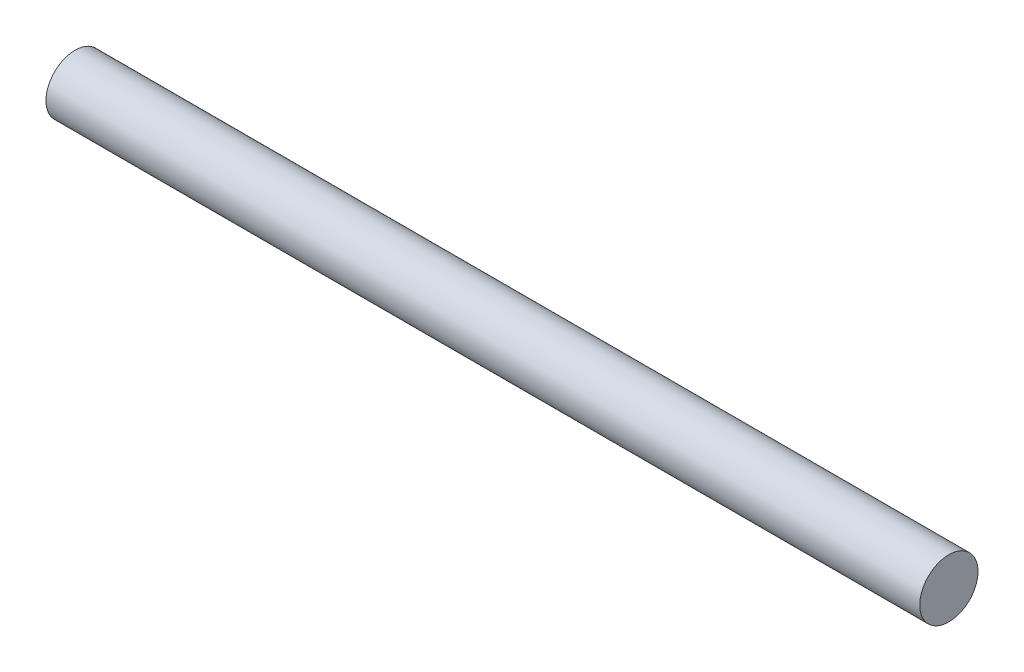
ISO-10303-21;
HEADER;
FILE_DESCRIPTION(('STEP AP214'),'2;1');
FILE_NAME('part.step','',(''),(''),'','','');
FILE_SCHEMA(('AUTOMOTIVE_DESIGN { 1 0 10303 214 1 1 1 1 }'));
ENDSEC;
DATA;
#1=APPLICATION_CONTEXT('core data for automotive mechanical design processes');
#2=APPLICATION_PROTOCOL_DEFINITION('international standard','automotive_design',2000,#1);
#3=PRODUCT_CONTEXT('',#1,'mechanical');
#4=PRODUCT('Part','Part','',(#3));
#5=PRODUCT_RELATED_PRODUCT_CATEGORY('part','',(#4));
#6=PRODUCT_DEFINITION_FORMATION('','',#4);
#7=PRODUCT_DEFINITION_CONTEXT('part definition',#1,'design');
#8=PRODUCT_DEFINITION('design','',#6,#7);
#9=PRODUCT_DEFINITION_SHAPE('','',#8);
#10=(LENGTH_UNIT() NAMED_UNIT(*) SI_UNIT(.MILLI.,.METRE.));
#11=(NAMED_UNIT(*) PLANE_ANGLE_UNIT() SI_UNIT($,.RADIAN.));
#12=(NAMED_UNIT(*) SI_UNIT($,.STERADIAN.) SOLID_ANGLE_UNIT());
#13=UNCERTAINTY_MEASURE_WITH_UNIT(LENGTH_MEASURE(1.E-05),#10,'distance_accuracy_value','');
#14=(GEOMETRIC_REPRESENTATION_CONTEXT(3) GLOBAL_UNCERTAINTY_ASSIGNED_CONTEXT((#13)) GLOBAL_UNIT_ASSIGNED_CONTEXT((#10,
#11,#12)) REPRESENTATION_CONTEXT('',''));
#15=CARTESIAN_POINT('',(0.,0.,0.));
#16=DIRECTION('',(0.,0.,1.));
#17=DIRECTION('',(1.,0.,0.));
#18=AXIS2_PLACEMENT_3D('',#15,#16,#17);
#19=CARTESIAN_POINT('',(120.,0.,0.));
#20=DIRECTION('',(-1.,0.,0.));
#21=DIRECTION('',(0.,0.,1.));
#22=AXIS2_PLACEMENT_3D('',#19,#20,#21);
#23=CYLINDRICAL_SURFACE('',#22,4.);
#24=CARTESIAN_POINT('',(120.,0.,0.));
#25=DIRECTION('',(1.,0.,0.));
#26=DIRECTION('',(0.,0.,-1.));
#27=AXIS2_PLACEMENT_3D('',#24,#25,#26);
#28=CIRCLE('',#27,4.);
#29=CARTESIAN_POINT('',(120.,0.,-4.));
#30=VERTEX_POINT('',#29);
#31=EDGE_CURVE('E10',#30,#30,#28,.T.);
#32=ORIENTED_EDGE('',*,*,#31,.F.);
#33=EDGE_LOOP('',(#32));
#34=FACE_BOUND('',#33,.T.);
#35=CARTESIAN_POINT('',(0.,0.,0.));
#36=DIRECTION('',(1.,0.,0.));
#37=DIRECTION('',(0.,0.,-1.));
#38=AXIS2_PLACEMENT_3D('',#35,#36,#37);
#39=CIRCLE('',#38,4.);
#40=CARTESIAN_POINT('',(0.,0.,-4.));
#41=VERTEX_POINT('',#40);
#42=EDGE_CURVE('E42',#41,#41,#39,.T.);
#43=ORIENTED_EDGE('',*,*,#42,.T.);
#44=EDGE_LOOP('',(#43));
#45=FACE_BOUND('',#44,.T.);
#46=ADVANCED_FACE('F39',(#34,#45),#23,.T.);
#47=CARTESIAN_POINT('',(120.,0.,0.));
#48=DIRECTION('',(1.,0.,0.));
#49=DIRECTION('',(0.,0.,-1.));
#50=AXIS2_PLACEMENT_3D('',#47,#48,#49);
#51=PLANE('',#50);
#52=ORIENTED_EDGE('',*,*,#31,.T.);
#53=EDGE_LOOP('',(#52));
#54=FACE_BOUND('',#53,.T.);
#55=ADVANCED_FACE('F56',(#54),#51,.T.);
#56=CARTESIAN_POINT('',(0.,0.,0.));
#57=DIRECTION('',(1.,0.,0.));
#58=DIRECTION('',(0.,0.,-1.));
#59=AXIS2_PLACEMENT_3D('',#56,#57,#58);
#60=PLANE('',#59);
#61=ORIENTED_EDGE('',*,*,#42,.F.);
#62=EDGE_LOOP('',(#61));
#63=FACE_BOUND('',#62,.T.);
#64=ADVANCED_FACE('F54',(#63),#60,.F.);
#65=CLOSED_SHELL('',(#46,#55,#64));
#66=MANIFOLD_SOLID_BREP('B2',#65);
#67=ADVANCED_BREP_SHAPE_REPRESENTATION('',(#18,#66),#14);
#68=SHAPE_DEFINITION_REPRESENTATION(#9,#67);
ENDSEC;
END-ISO-10303-21;
